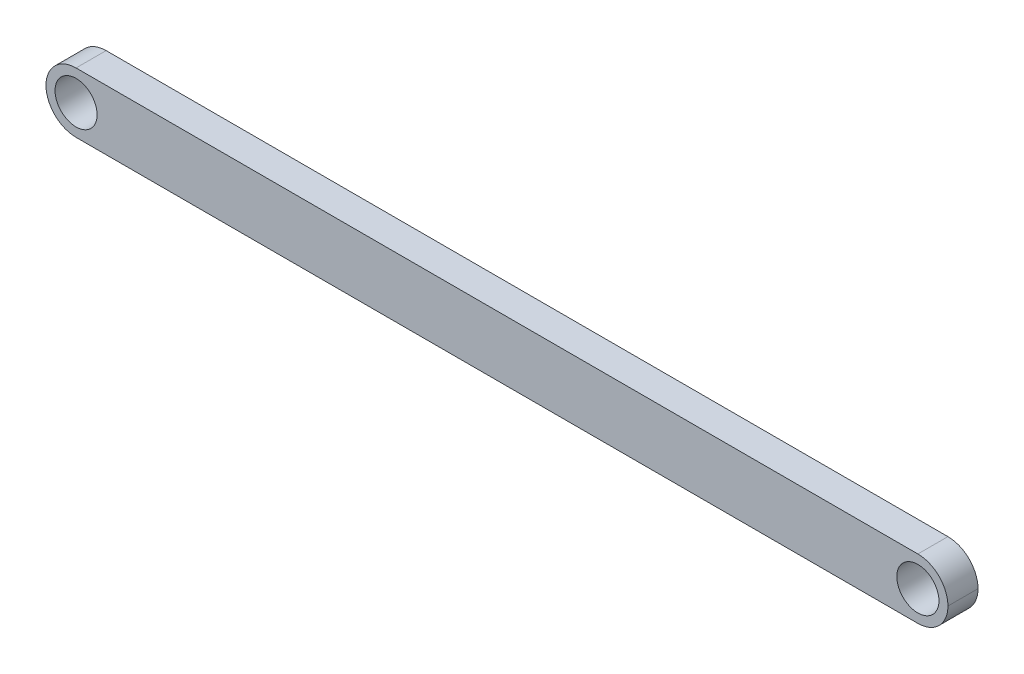
ISO-10303-21;
HEADER;
FILE_DESCRIPTION(('STEP AP214'),'2;1');
FILE_NAME('part.step','',(''),(''),'','','');
FILE_SCHEMA(('AUTOMOTIVE_DESIGN { 1 0 10303 214 1 1 1 1 }'));
ENDSEC;
DATA;
#1=APPLICATION_CONTEXT('core data for automotive mechanical design processes');
#2=APPLICATION_PROTOCOL_DEFINITION('international standard','automotive_design',2000,#1);
#3=PRODUCT_CONTEXT('',#1,'mechanical');
#4=PRODUCT('Part','Part','',(#3));
#5=PRODUCT_RELATED_PRODUCT_CATEGORY('part','',(#4));
#6=PRODUCT_DEFINITION_FORMATION('','',#4);
#7=PRODUCT_DEFINITION_CONTEXT('part definition',#1,'design');
#8=PRODUCT_DEFINITION('design','',#6,#7);
#9=PRODUCT_DEFINITION_SHAPE('','',#8);
#10=(LENGTH_UNIT() NAMED_UNIT(*) SI_UNIT(.MILLI.,.METRE.));
#11=(NAMED_UNIT(*) PLANE_ANGLE_UNIT() SI_UNIT($,.RADIAN.));
#12=(NAMED_UNIT(*) SI_UNIT($,.STERADIAN.) SOLID_ANGLE_UNIT());
#13=UNCERTAINTY_MEASURE_WITH_UNIT(LENGTH_MEASURE(1.E-05),#10,'distance_accuracy_value','');
#14=(GEOMETRIC_REPRESENTATION_CONTEXT(3) GLOBAL_UNCERTAINTY_ASSIGNED_CONTEXT((#13)) GLOBAL_UNIT_ASSIGNED_CONTEXT((#10,
#11,#12)) REPRESENTATION_CONTEXT('',''));
#15=CARTESIAN_POINT('',(0.,0.,0.));
#16=DIRECTION('',(0.,0.,1.));
#17=DIRECTION('',(1.,0.,0.));
#18=AXIS2_PLACEMENT_3D('',#15,#16,#17);
#19=CARTESIAN_POINT('',(0.,0.,10.));
#20=DIRECTION('',(0.,0.,-1.));
#21=DIRECTION('',(-1.,0.,0.));
#22=AXIS2_PLACEMENT_3D('',#19,#20,#21);
#23=PLANE('',#22);
#24=CARTESIAN_POINT('',(140.,0.,10.));
#25=DIRECTION('',(0.,0.,-1.));
#26=DIRECTION('',(-1.,0.,0.));
#27=AXIS2_PLACEMENT_3D('',#24,#25,#26);
#28=CIRCLE('',#27,10.);
#29=CARTESIAN_POINT('',(140.,-10.,10.));
#30=VERTEX_POINT('',#29);
#31=CARTESIAN_POINT('',(150.,0.,10.));
#32=VERTEX_POINT('',#31);
#33=EDGE_CURVE('E134',#30,#32,#28,.F.);
#34=ORIENTED_EDGE('',*,*,#33,.T.);
#35=CARTESIAN_POINT('',(140.,0.,10.));
#36=DIRECTION('',(0.,0.,-1.));
#37=DIRECTION('',(-1.,0.,0.));
#38=AXIS2_PLACEMENT_3D('',#35,#36,#37);
#39=CIRCLE('',#38,10.);
#40=CARTESIAN_POINT('',(140.,10.,10.));
#41=VERTEX_POINT('',#40);
#42=EDGE_CURVE('E136',#32,#41,#39,.F.);
#43=ORIENTED_EDGE('',*,*,#42,.T.);
#44=DIRECTION('',(-1.,0.,0.));
#45=VECTOR('',#44,1.);
#46=CARTESIAN_POINT('',(-150.,10.,10.));
#47=LINE('',#46,#45);
#48=CARTESIAN_POINT('',(-140.,10.,10.));
#49=VERTEX_POINT('',#48);
#50=EDGE_CURVE('E109',#41,#49,#47,.T.);
#51=ORIENTED_EDGE('',*,*,#50,.T.);
#52=CARTESIAN_POINT('',(-140.,0.,10.));
#53=DIRECTION('',(0.,0.,-1.));
#54=DIRECTION('',(-1.,0.,0.));
#55=AXIS2_PLACEMENT_3D('',#52,#53,#54);
#56=CIRCLE('',#55,10.);
#57=CARTESIAN_POINT('',(-150.,0.,10.));
#58=VERTEX_POINT('',#57);
#59=EDGE_CURVE('E99',#49,#58,#56,.F.);
#60=ORIENTED_EDGE('',*,*,#59,.T.);
#61=CARTESIAN_POINT('',(-140.,0.,10.));
#62=DIRECTION('',(0.,0.,-1.));
#63=DIRECTION('',(-1.,0.,0.));
#64=AXIS2_PLACEMENT_3D('',#61,#62,#63);
#65=CIRCLE('',#64,10.);
#66=CARTESIAN_POINT('',(-140.,-10.,10.));
#67=VERTEX_POINT('',#66);
#68=EDGE_CURVE('E57',#58,#67,#65,.F.);
#69=ORIENTED_EDGE('',*,*,#68,.T.);
#70=DIRECTION('',(1.,0.,0.));
#71=VECTOR('',#70,1.);
#72=CARTESIAN_POINT('',(-150.,-10.,10.));
#73=LINE('',#72,#71);
#74=EDGE_CURVE('E124',#67,#30,#73,.T.);
#75=ORIENTED_EDGE('',*,*,#74,.T.);
#76=EDGE_LOOP('',(#34,#43,#51,#60,#69,#75));
#77=FACE_BOUND('',#76,.T.);
#78=CARTESIAN_POINT('',(-140.,0.,10.));
#79=DIRECTION('',(0.,0.,1.));
#80=DIRECTION('',(1.,0.,0.));
#81=AXIS2_PLACEMENT_3D('',#78,#79,#80);
#82=CIRCLE('',#81,7.00000000000001);
#83=CARTESIAN_POINT('',(-133.,0.,10.));
#84=VERTEX_POINT('',#83);
#85=EDGE_CURVE('E117',#84,#84,#82,.T.);
#86=ORIENTED_EDGE('',*,*,#85,.F.);
#87=EDGE_LOOP('',(#86));
#88=FACE_BOUND('',#87,.T.);
#89=CARTESIAN_POINT('',(140.,0.,10.));
#90=DIRECTION('',(0.,0.,1.));
#91=DIRECTION('',(1.,0.,0.));
#92=AXIS2_PLACEMENT_3D('',#89,#90,#91);
#93=CIRCLE('',#92,7.00000000000001);
#94=CARTESIAN_POINT('',(147.,0.,10.));
#95=VERTEX_POINT('',#94);
#96=EDGE_CURVE('E141',#95,#95,#93,.T.);
#97=ORIENTED_EDGE('',*,*,#96,.F.);
#98=EDGE_LOOP('',(#97));
#99=FACE_BOUND('',#98,.T.);
#100=ADVANCED_FACE('F35',(#77,#88,#99),#23,.F.);
#101=CARTESIAN_POINT('',(0.,0.,0.));
#102=DIRECTION('',(0.,0.,-1.));
#103=DIRECTION('',(-1.,0.,0.));
#104=AXIS2_PLACEMENT_3D('',#101,#102,#103);
#105=PLANE('',#104);
#106=CARTESIAN_POINT('',(-140.,0.,0.));
#107=DIRECTION('',(0.,0.,1.));
#108=DIRECTION('',(1.,0.,0.));
#109=AXIS2_PLACEMENT_3D('',#106,#107,#108);
#110=CIRCLE('',#109,7.00000000000001);
#111=CARTESIAN_POINT('',(-133.,0.,0.));
#112=VERTEX_POINT('',#111);
#113=EDGE_CURVE('E121',#112,#112,#110,.T.);
#114=ORIENTED_EDGE('',*,*,#113,.T.);
#115=EDGE_LOOP('',(#114));
#116=FACE_BOUND('',#115,.T.);
#117=DIRECTION('',(-1.,0.,0.));
#118=VECTOR('',#117,1.);
#119=CARTESIAN_POINT('',(-150.,10.,0.));
#120=LINE('',#119,#118);
#121=CARTESIAN_POINT('',(140.,10.,0.));
#122=VERTEX_POINT('',#121);
#123=CARTESIAN_POINT('',(-140.,10.,0.));
#124=VERTEX_POINT('',#123);
#125=EDGE_CURVE('E106',#122,#124,#120,.T.);
#126=ORIENTED_EDGE('',*,*,#125,.F.);
#127=CARTESIAN_POINT('',(140.,0.,0.));
#128=DIRECTION('',(0.,0.,-1.));
#129=DIRECTION('',(-1.,0.,0.));
#130=AXIS2_PLACEMENT_3D('',#127,#128,#129);
#131=CIRCLE('',#130,10.);
#132=CARTESIAN_POINT('',(150.,0.,0.));
#133=VERTEX_POINT('',#132);
#134=EDGE_CURVE('E89',#122,#133,#131,.T.);
#135=ORIENTED_EDGE('',*,*,#134,.T.);
#136=CARTESIAN_POINT('',(140.,0.,0.));
#137=DIRECTION('',(0.,0.,-1.));
#138=DIRECTION('',(-1.,0.,0.));
#139=AXIS2_PLACEMENT_3D('',#136,#137,#138);
#140=CIRCLE('',#139,10.);
#141=CARTESIAN_POINT('',(140.,-10.,0.));
#142=VERTEX_POINT('',#141);
#143=EDGE_CURVE('E100',#133,#142,#140,.T.);
#144=ORIENTED_EDGE('',*,*,#143,.T.);
#145=DIRECTION('',(1.,0.,0.));
#146=VECTOR('',#145,1.);
#147=CARTESIAN_POINT('',(-150.,-10.,0.));
#148=LINE('',#147,#146);
#149=CARTESIAN_POINT('',(-140.,-10.,0.));
#150=VERTEX_POINT('',#149);
#151=EDGE_CURVE('E116',#150,#142,#148,.T.);
#152=ORIENTED_EDGE('',*,*,#151,.F.);
#153=CARTESIAN_POINT('',(-140.,0.,0.));
#154=DIRECTION('',(0.,0.,-1.));
#155=DIRECTION('',(-1.,0.,0.));
#156=AXIS2_PLACEMENT_3D('',#153,#154,#155);
#157=CIRCLE('',#156,10.);
#158=CARTESIAN_POINT('',(-150.,0.,0.));
#159=VERTEX_POINT('',#158);
#160=EDGE_CURVE('E129',#150,#159,#157,.T.);
#161=ORIENTED_EDGE('',*,*,#160,.T.);
#162=CARTESIAN_POINT('',(-140.,0.,0.));
#163=DIRECTION('',(0.,0.,-1.));
#164=DIRECTION('',(-1.,0.,0.));
#165=AXIS2_PLACEMENT_3D('',#162,#163,#164);
#166=CIRCLE('',#165,10.);
#167=EDGE_CURVE('E110',#159,#124,#166,.T.);
#168=ORIENTED_EDGE('',*,*,#167,.T.);
#169=EDGE_LOOP('',(#126,#135,#144,#152,#161,#168));
#170=FACE_BOUND('',#169,.T.);
#171=CARTESIAN_POINT('',(140.,0.,0.));
#172=DIRECTION('',(0.,0.,1.));
#173=DIRECTION('',(1.,0.,0.));
#174=AXIS2_PLACEMENT_3D('',#171,#172,#173);
#175=CIRCLE('',#174,7.00000000000001);
#176=CARTESIAN_POINT('',(147.,0.,0.));
#177=VERTEX_POINT('',#176);
#178=EDGE_CURVE('E139',#177,#177,#175,.T.);
#179=ORIENTED_EDGE('',*,*,#178,.T.);
#180=EDGE_LOOP('',(#179));
#181=FACE_BOUND('',#180,.T.);
#182=ADVANCED_FACE('F113',(#116,#170,#181),#105,.T.);
#183=CARTESIAN_POINT('',(-150.,10.,10.));
#184=DIRECTION('',(0.,-1.,0.));
#185=DIRECTION('',(0.,0.,-1.));
#186=AXIS2_PLACEMENT_3D('',#183,#184,#185);
#187=PLANE('',#186);
#188=ORIENTED_EDGE('',*,*,#50,.F.);
#189=DIRECTION('',(0.,0.,-1.));
#190=VECTOR('',#189,1.);
#191=CARTESIAN_POINT('',(140.,10.,10.));
#192=LINE('',#191,#190);
#193=EDGE_CURVE('E93',#41,#122,#192,.T.);
#194=ORIENTED_EDGE('',*,*,#193,.T.);
#195=ORIENTED_EDGE('',*,*,#125,.T.);
#196=DIRECTION('',(0.,0.,-1.));
#197=VECTOR('',#196,1.);
#198=CARTESIAN_POINT('',(-140.,10.,10.));
#199=LINE('',#198,#197);
#200=EDGE_CURVE('E111',#124,#49,#199,.F.);
#201=ORIENTED_EDGE('',*,*,#200,.T.);
#202=EDGE_LOOP('',(#188,#194,#195,#201));
#203=FACE_BOUND('',#202,.T.);
#204=ADVANCED_FACE('F105',(#203),#187,.F.);
#205=CARTESIAN_POINT('',(-150.,-10.,10.));
#206=DIRECTION('',(0.,1.,0.));
#207=DIRECTION('',(0.,0.,1.));
#208=AXIS2_PLACEMENT_3D('',#205,#206,#207);
#209=PLANE('',#208);
#210=ORIENTED_EDGE('',*,*,#151,.T.);
#211=DIRECTION('',(0.,0.,-1.));
#212=VECTOR('',#211,1.);
#213=CARTESIAN_POINT('',(140.,-10.,10.));
#214=LINE('',#213,#212);
#215=EDGE_CURVE('E11',#142,#30,#214,.F.);
#216=ORIENTED_EDGE('',*,*,#215,.T.);
#217=ORIENTED_EDGE('',*,*,#74,.F.);
#218=DIRECTION('',(0.,0.,-1.));
#219=VECTOR('',#218,1.);
#220=CARTESIAN_POINT('',(-140.,-10.,10.));
#221=LINE('',#220,#219);
#222=EDGE_CURVE('E44',#67,#150,#221,.T.);
#223=ORIENTED_EDGE('',*,*,#222,.T.);
#224=EDGE_LOOP('',(#210,#216,#217,#223));
#225=FACE_BOUND('',#224,.T.);
#226=ADVANCED_FACE('F171',(#225),#209,.F.);
#227=CARTESIAN_POINT('',(-140.,0.,10.));
#228=DIRECTION('',(0.,0.,-1.));
#229=DIRECTION('',(-1.,0.,0.));
#230=AXIS2_PLACEMENT_3D('',#227,#228,#229);
#231=CYLINDRICAL_SURFACE('',#230,7.00000000000001);
#232=ORIENTED_EDGE('',*,*,#85,.T.);
#233=EDGE_LOOP('',(#232));
#234=FACE_BOUND('',#233,.T.);
#235=ORIENTED_EDGE('',*,*,#113,.F.);
#236=EDGE_LOOP('',(#235));
#237=FACE_BOUND('',#236,.T.);
#238=ADVANCED_FACE('F168',(#234,#237),#231,.F.);
#239=CARTESIAN_POINT('',(140.,0.,10.));
#240=DIRECTION('',(0.,0.,-1.));
#241=DIRECTION('',(-1.,0.,0.));
#242=AXIS2_PLACEMENT_3D('',#239,#240,#241);
#243=CYLINDRICAL_SURFACE('',#242,7.00000000000001);
#244=ORIENTED_EDGE('',*,*,#96,.T.);
#245=EDGE_LOOP('',(#244));
#246=FACE_BOUND('',#245,.T.);
#247=ORIENTED_EDGE('',*,*,#178,.F.);
#248=EDGE_LOOP('',(#247));
#249=FACE_BOUND('',#248,.T.);
#250=ADVANCED_FACE('F157',(#246,#249),#243,.F.);
#251=CARTESIAN_POINT('',(140.,0.,10.));
#252=DIRECTION('',(0.,0.,-1.));
#253=DIRECTION('',(-1.,0.,0.));
#254=AXIS2_PLACEMENT_3D('',#251,#252,#253);
#255=CYLINDRICAL_SURFACE('',#254,10.);
#256=DIRECTION('',(0.,0.,-1.));
#257=VECTOR('',#256,1.);
#258=CARTESIAN_POINT('',(150.,0.,10.));
#259=LINE('',#258,#257);
#260=EDGE_CURVE('E95',#32,#133,#259,.T.);
#261=ORIENTED_EDGE('',*,*,#260,.F.);
#262=ORIENTED_EDGE('',*,*,#33,.F.);
#263=ORIENTED_EDGE('',*,*,#215,.F.);
#264=ORIENTED_EDGE('',*,*,#143,.F.);
#265=EDGE_LOOP('',(#261,#262,#263,#264));
#266=FACE_BOUND('',#265,.T.);
#267=ADVANCED_FACE('F178',(#266),#255,.T.);
#268=CARTESIAN_POINT('',(140.,0.,10.));
#269=DIRECTION('',(0.,0.,-1.));
#270=DIRECTION('',(-1.,0.,0.));
#271=AXIS2_PLACEMENT_3D('',#268,#269,#270);
#272=CYLINDRICAL_SURFACE('',#271,10.);
#273=ORIENTED_EDGE('',*,*,#42,.F.);
#274=ORIENTED_EDGE('',*,*,#260,.T.);
#275=ORIENTED_EDGE('',*,*,#134,.F.);
#276=ORIENTED_EDGE('',*,*,#193,.F.);
#277=EDGE_LOOP('',(#273,#274,#275,#276));
#278=FACE_BOUND('',#277,.T.);
#279=ADVANCED_FACE('F92',(#278),#272,.T.);
#280=CARTESIAN_POINT('',(-140.,0.,10.));
#281=DIRECTION('',(0.,0.,-1.));
#282=DIRECTION('',(-1.,0.,0.));
#283=AXIS2_PLACEMENT_3D('',#280,#281,#282);
#284=CYLINDRICAL_SURFACE('',#283,10.);
#285=DIRECTION('',(0.,0.,-1.));
#286=VECTOR('',#285,1.);
#287=CARTESIAN_POINT('',(-150.,0.,10.));
#288=LINE('',#287,#286);
#289=EDGE_CURVE('E39',#58,#159,#288,.T.);
#290=ORIENTED_EDGE('',*,*,#289,.F.);
#291=ORIENTED_EDGE('',*,*,#59,.F.);
#292=ORIENTED_EDGE('',*,*,#200,.F.);
#293=ORIENTED_EDGE('',*,*,#167,.F.);
#294=EDGE_LOOP('',(#290,#291,#292,#293));
#295=FACE_BOUND('',#294,.T.);
#296=ADVANCED_FACE('F37',(#295),#284,.T.);
#297=CARTESIAN_POINT('',(-140.,0.,10.));
#298=DIRECTION('',(0.,0.,-1.));
#299=DIRECTION('',(-1.,0.,0.));
#300=AXIS2_PLACEMENT_3D('',#297,#298,#299);
#301=CYLINDRICAL_SURFACE('',#300,10.);
#302=ORIENTED_EDGE('',*,*,#68,.F.);
#303=ORIENTED_EDGE('',*,*,#289,.T.);
#304=ORIENTED_EDGE('',*,*,#160,.F.);
#305=ORIENTED_EDGE('',*,*,#222,.F.);
#306=EDGE_LOOP('',(#302,#303,#304,#305));
#307=FACE_BOUND('',#306,.T.);
#308=ADVANCED_FACE('F146',(#307),#301,.T.);
#309=CLOSED_SHELL('',(#100,#182,#204,#226,#238,#250,#267,#279,#296,#308));
#310=MANIFOLD_SOLID_BREP('B2',#309);
#311=ADVANCED_BREP_SHAPE_REPRESENTATION('',(#18,#310),#14);
#312=SHAPE_DEFINITION_REPRESENTATION(#9,#311);
ENDSEC;
END-ISO-10303-21;
